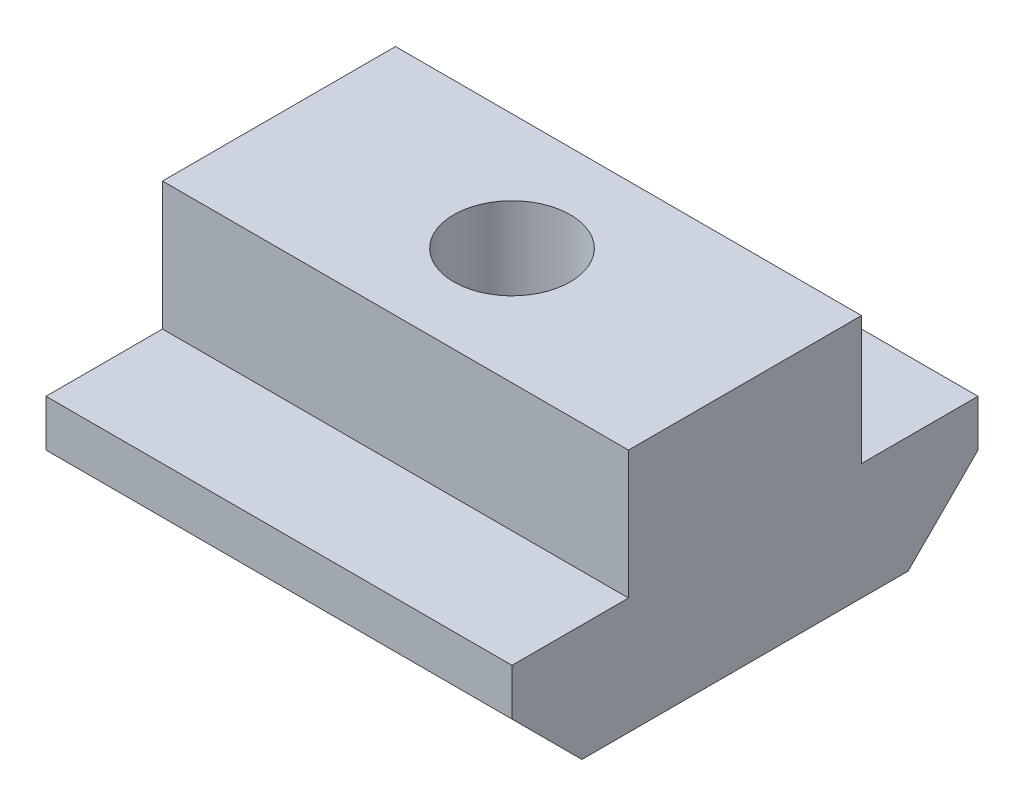
ISO-10303-21;
HEADER;
FILE_DESCRIPTION(('STEP AP214'),'2;1');
FILE_NAME('part.step','',(''),(''),'','','');
FILE_SCHEMA(('AUTOMOTIVE_DESIGN { 1 0 10303 214 1 1 1 1 }'));
ENDSEC;
DATA;
#1=APPLICATION_CONTEXT('core data for automotive mechanical design processes');
#2=APPLICATION_PROTOCOL_DEFINITION('international standard','automotive_design',2000,#1);
#3=PRODUCT_CONTEXT('',#1,'mechanical');
#4=PRODUCT('Part','Part','',(#3));
#5=PRODUCT_RELATED_PRODUCT_CATEGORY('part','',(#4));
#6=PRODUCT_DEFINITION_FORMATION('','',#4);
#7=PRODUCT_DEFINITION_CONTEXT('part definition',#1,'design');
#8=PRODUCT_DEFINITION('design','',#6,#7);
#9=PRODUCT_DEFINITION_SHAPE('','',#8);
#10=(LENGTH_UNIT() NAMED_UNIT(*) SI_UNIT(.MILLI.,.METRE.));
#11=(NAMED_UNIT(*) PLANE_ANGLE_UNIT() SI_UNIT($,.RADIAN.));
#12=(NAMED_UNIT(*) SI_UNIT($,.STERADIAN.) SOLID_ANGLE_UNIT());
#13=UNCERTAINTY_MEASURE_WITH_UNIT(LENGTH_MEASURE(1.E-05),#10,'distance_accuracy_value','');
#14=(GEOMETRIC_REPRESENTATION_CONTEXT(3) GLOBAL_UNCERTAINTY_ASSIGNED_CONTEXT((#13)) GLOBAL_UNIT_ASSIGNED_CONTEXT((#10,
#11,#12)) REPRESENTATION_CONTEXT('',''));
#15=CARTESIAN_POINT('',(0.,0.,0.));
#16=DIRECTION('',(0.,0.,1.));
#17=DIRECTION('',(1.,0.,0.));
#18=AXIS2_PLACEMENT_3D('',#15,#16,#17);
#19=CARTESIAN_POINT('',(20.,-2.25,10.));
#20=DIRECTION('',(0.,0.707106781186548,-0.707106781186548));
#21=DIRECTION('',(0.,0.707106781186548,0.707106781186548));
#22=AXIS2_PLACEMENT_3D('',#19,#20,#21);
#23=PLANE('',#22);
#24=DIRECTION('',(0.,-0.707106781186548,-0.707106781186548));
#25=VECTOR('',#24,1.);
#26=CARTESIAN_POINT('',(0.,-2.25,10.));
#27=LINE('',#26,#25);
#28=CARTESIAN_POINT('',(0.,-2.25,10.));
#29=VERTEX_POINT('',#28);
#30=CARTESIAN_POINT('',(0.,-5.25,7.));
#31=VERTEX_POINT('',#30);
#32=EDGE_CURVE('E143',#29,#31,#27,.T.);
#33=ORIENTED_EDGE('',*,*,#32,.T.);
#34=DIRECTION('',(-1.,0.,0.));
#35=VECTOR('',#34,1.);
#36=CARTESIAN_POINT('',(20.,-5.25,7.));
#37=LINE('',#36,#35);
#38=CARTESIAN_POINT('',(20.,-5.25,7.));
#39=VERTEX_POINT('',#38);
#40=EDGE_CURVE('E11',#39,#31,#37,.T.);
#41=ORIENTED_EDGE('',*,*,#40,.F.);
#42=DIRECTION('',(0.,-0.707106781186548,-0.707106781186548));
#43=VECTOR('',#42,1.);
#44=CARTESIAN_POINT('',(20.,-2.25,10.));
#45=LINE('',#44,#43);
#46=CARTESIAN_POINT('',(20.,-2.25,10.));
#47=VERTEX_POINT('',#46);
#48=EDGE_CURVE('E162',#47,#39,#45,.T.);
#49=ORIENTED_EDGE('',*,*,#48,.F.);
#50=DIRECTION('',(-1.,0.,0.));
#51=VECTOR('',#50,1.);
#52=CARTESIAN_POINT('',(20.,-2.25,10.));
#53=LINE('',#52,#51);
#54=EDGE_CURVE('E139',#47,#29,#53,.T.);
#55=ORIENTED_EDGE('',*,*,#54,.T.);
#56=EDGE_LOOP('',(#33,#41,#49,#55));
#57=FACE_BOUND('',#56,.T.);
#58=ADVANCED_FACE('F35',(#57),#23,.F.);
#59=CARTESIAN_POINT('',(20.,-5.25,7.));
#60=DIRECTION('',(0.,1.,0.));
#61=DIRECTION('',(0.,0.,1.));
#62=AXIS2_PLACEMENT_3D('',#59,#60,#61);
#63=PLANE('',#62);
#64=CARTESIAN_POINT('',(10.,-5.25,0.));
#65=DIRECTION('',(0.,1.,0.));
#66=DIRECTION('',(0.,0.,1.));
#67=AXIS2_PLACEMENT_3D('',#64,#65,#66);
#68=CIRCLE('',#67,2.5);
#69=CARTESIAN_POINT('',(10.,-5.25,2.5));
#70=VERTEX_POINT('',#69);
#71=EDGE_CURVE('E147',#70,#70,#68,.T.);
#72=ORIENTED_EDGE('',*,*,#71,.T.);
#73=EDGE_LOOP('',(#72));
#74=FACE_BOUND('',#73,.T.);
#75=DIRECTION('',(0.,0.,-1.));
#76=VECTOR('',#75,1.);
#77=CARTESIAN_POINT('',(0.,-5.25,7.));
#78=LINE('',#77,#76);
#79=CARTESIAN_POINT('',(0.,-5.25,-7.));
#80=VERTEX_POINT('',#79);
#81=EDGE_CURVE('E146',#31,#80,#78,.T.);
#82=ORIENTED_EDGE('',*,*,#81,.T.);
#83=DIRECTION('',(-1.,0.,0.));
#84=VECTOR('',#83,1.);
#85=CARTESIAN_POINT('',(20.,-5.25,-7.));
#86=LINE('',#85,#84);
#87=CARTESIAN_POINT('',(20.,-5.25,-7.));
#88=VERTEX_POINT('',#87);
#89=EDGE_CURVE('E43',#88,#80,#86,.T.);
#90=ORIENTED_EDGE('',*,*,#89,.F.);
#91=DIRECTION('',(0.,0.,-1.));
#92=VECTOR('',#91,1.);
#93=CARTESIAN_POINT('',(20.,-5.25,7.));
#94=LINE('',#93,#92);
#95=EDGE_CURVE('E100',#39,#88,#94,.T.);
#96=ORIENTED_EDGE('',*,*,#95,.F.);
#97=ORIENTED_EDGE('',*,*,#40,.T.);
#98=EDGE_LOOP('',(#82,#90,#96,#97));
#99=FACE_BOUND('',#98,.T.);
#100=ADVANCED_FACE('F215',(#74,#99),#63,.F.);
#101=CARTESIAN_POINT('',(20.,-5.25,-7.));
#102=DIRECTION('',(0.,0.707106781186548,0.707106781186547));
#103=DIRECTION('',(0.,-0.707106781186547,0.707106781186548));
#104=AXIS2_PLACEMENT_3D('',#101,#102,#103);
#105=PLANE('',#104);
#106=DIRECTION('',(0.,0.707106781186547,-0.707106781186548));
#107=VECTOR('',#106,1.);
#108=CARTESIAN_POINT('',(0.,-5.25,-7.));
#109=LINE('',#108,#107);
#110=CARTESIAN_POINT('',(0.,-2.25,-10.));
#111=VERTEX_POINT('',#110);
#112=EDGE_CURVE('E149',#80,#111,#109,.T.);
#113=ORIENTED_EDGE('',*,*,#112,.T.);
#114=DIRECTION('',(-1.,0.,0.));
#115=VECTOR('',#114,1.);
#116=CARTESIAN_POINT('',(20.,-2.25,-10.));
#117=LINE('',#116,#115);
#118=CARTESIAN_POINT('',(20.,-2.25,-10.));
#119=VERTEX_POINT('',#118);
#120=EDGE_CURVE('E175',#119,#111,#117,.T.);
#121=ORIENTED_EDGE('',*,*,#120,.F.);
#122=DIRECTION('',(0.,0.707106781186547,-0.707106781186548));
#123=VECTOR('',#122,1.);
#124=CARTESIAN_POINT('',(20.,-5.25,-7.));
#125=LINE('',#124,#123);
#126=EDGE_CURVE('E183',#88,#119,#125,.T.);
#127=ORIENTED_EDGE('',*,*,#126,.F.);
#128=ORIENTED_EDGE('',*,*,#89,.T.);
#129=EDGE_LOOP('',(#113,#121,#127,#128));
#130=FACE_BOUND('',#129,.T.);
#131=ADVANCED_FACE('F181',(#130),#105,.F.);
#132=CARTESIAN_POINT('',(20.,-2.25,-10.));
#133=DIRECTION('',(0.,0.,1.));
#134=DIRECTION('',(1.,0.,0.));
#135=AXIS2_PLACEMENT_3D('',#132,#133,#134);
#136=PLANE('',#135);
#137=DIRECTION('',(0.,1.,0.));
#138=VECTOR('',#137,1.);
#139=CARTESIAN_POINT('',(0.,-2.25,-10.));
#140=LINE('',#139,#138);
#141=CARTESIAN_POINT('',(0.,-0.249999999999999,-10.));
#142=VERTEX_POINT('',#141);
#143=EDGE_CURVE('E151',#111,#142,#140,.T.);
#144=ORIENTED_EDGE('',*,*,#143,.T.);
#145=DIRECTION('',(-1.,0.,0.));
#146=VECTOR('',#145,1.);
#147=CARTESIAN_POINT('',(20.,-0.249999999999999,-10.));
#148=LINE('',#147,#146);
#149=CARTESIAN_POINT('',(20.,-0.249999999999999,-10.));
#150=VERTEX_POINT('',#149);
#151=EDGE_CURVE('E172',#150,#142,#148,.T.);
#152=ORIENTED_EDGE('',*,*,#151,.F.);
#153=DIRECTION('',(0.,1.,0.));
#154=VECTOR('',#153,1.);
#155=CARTESIAN_POINT('',(20.,-2.25,-10.));
#156=LINE('',#155,#154);
#157=EDGE_CURVE('E201',#119,#150,#156,.T.);
#158=ORIENTED_EDGE('',*,*,#157,.F.);
#159=ORIENTED_EDGE('',*,*,#120,.T.);
#160=EDGE_LOOP('',(#144,#152,#158,#159));
#161=FACE_BOUND('',#160,.T.);
#162=ADVANCED_FACE('F192',(#161),#136,.F.);
#163=CARTESIAN_POINT('',(20.,-0.249999999999999,-5.));
#164=DIRECTION('',(0.,-1.,0.));
#165=DIRECTION('',(0.,0.,-1.));
#166=AXIS2_PLACEMENT_3D('',#163,#164,#165);
#167=PLANE('',#166);
#168=DIRECTION('',(0.,0.,1.));
#169=VECTOR('',#168,1.);
#170=CARTESIAN_POINT('',(0.,-0.249999999999999,-5.));
#171=LINE('',#170,#169);
#172=CARTESIAN_POINT('',(0.,-0.249999999999999,-5.));
#173=VERTEX_POINT('',#172);
#174=EDGE_CURVE('E153',#142,#173,#171,.T.);
#175=ORIENTED_EDGE('',*,*,#174,.T.);
#176=DIRECTION('',(-1.,0.,0.));
#177=VECTOR('',#176,1.);
#178=CARTESIAN_POINT('',(20.,-0.249999999999999,-5.));
#179=LINE('',#178,#177);
#180=CARTESIAN_POINT('',(20.,-0.249999999999999,-5.));
#181=VERTEX_POINT('',#180);
#182=EDGE_CURVE('E169',#181,#173,#179,.T.);
#183=ORIENTED_EDGE('',*,*,#182,.F.);
#184=DIRECTION('',(0.,0.,1.));
#185=VECTOR('',#184,1.);
#186=CARTESIAN_POINT('',(20.,-0.249999999999999,-5.));
#187=LINE('',#186,#185);
#188=EDGE_CURVE('E198',#150,#181,#187,.T.);
#189=ORIENTED_EDGE('',*,*,#188,.F.);
#190=ORIENTED_EDGE('',*,*,#151,.T.);
#191=EDGE_LOOP('',(#175,#183,#189,#190));
#192=FACE_BOUND('',#191,.T.);
#193=ADVANCED_FACE('F196',(#192),#167,.F.);
#194=CARTESIAN_POINT('',(20.,5.25,-5.));
#195=DIRECTION('',(0.,0.,1.));
#196=DIRECTION('',(0.,-1.,0.));
#197=AXIS2_PLACEMENT_3D('',#194,#195,#196);
#198=PLANE('',#197);
#199=DIRECTION('',(0.,1.,0.));
#200=VECTOR('',#199,1.);
#201=CARTESIAN_POINT('',(0.,5.25,-5.));
#202=LINE('',#201,#200);
#203=CARTESIAN_POINT('',(0.,5.25,-5.));
#204=VERTEX_POINT('',#203);
#205=EDGE_CURVE('E155',#173,#204,#202,.T.);
#206=ORIENTED_EDGE('',*,*,#205,.T.);
#207=DIRECTION('',(-1.,0.,0.));
#208=VECTOR('',#207,1.);
#209=CARTESIAN_POINT('',(20.,5.25,-5.));
#210=LINE('',#209,#208);
#211=CARTESIAN_POINT('',(20.,5.25,-5.));
#212=VERTEX_POINT('',#211);
#213=EDGE_CURVE('E166',#212,#204,#210,.T.);
#214=ORIENTED_EDGE('',*,*,#213,.F.);
#215=DIRECTION('',(0.,1.,0.));
#216=VECTOR('',#215,1.);
#217=CARTESIAN_POINT('',(20.,5.25,-5.));
#218=LINE('',#217,#216);
#219=EDGE_CURVE('E200',#181,#212,#218,.T.);
#220=ORIENTED_EDGE('',*,*,#219,.F.);
#221=ORIENTED_EDGE('',*,*,#182,.T.);
#222=EDGE_LOOP('',(#206,#214,#220,#221));
#223=FACE_BOUND('',#222,.T.);
#224=ADVANCED_FACE('F226',(#223),#198,.F.);
#225=CARTESIAN_POINT('',(20.,5.25,5.));
#226=DIRECTION('',(0.,-1.,0.));
#227=DIRECTION('',(0.,0.,-1.));
#228=AXIS2_PLACEMENT_3D('',#225,#226,#227);
#229=PLANE('',#228);
#230=CARTESIAN_POINT('',(10.,5.25,0.));
#231=DIRECTION('',(0.,1.,0.));
#232=DIRECTION('',(0.,0.,1.));
#233=AXIS2_PLACEMENT_3D('',#230,#231,#232);
#234=CIRCLE('',#233,2.5);
#235=CARTESIAN_POINT('',(10.,5.25,2.5));
#236=VERTEX_POINT('',#235);
#237=EDGE_CURVE('E209',#236,#236,#234,.T.);
#238=ORIENTED_EDGE('',*,*,#237,.F.);
#239=EDGE_LOOP('',(#238));
#240=FACE_BOUND('',#239,.T.);
#241=DIRECTION('',(0.,0.,1.));
#242=VECTOR('',#241,1.);
#243=CARTESIAN_POINT('',(0.,5.25,5.));
#244=LINE('',#243,#242);
#245=CARTESIAN_POINT('',(0.,5.25,5.));
#246=VERTEX_POINT('',#245);
#247=EDGE_CURVE('E157',#204,#246,#244,.T.);
#248=ORIENTED_EDGE('',*,*,#247,.T.);
#249=DIRECTION('',(-1.,0.,0.));
#250=VECTOR('',#249,1.);
#251=CARTESIAN_POINT('',(20.,5.25,5.));
#252=LINE('',#251,#250);
#253=CARTESIAN_POINT('',(20.,5.25,5.));
#254=VERTEX_POINT('',#253);
#255=EDGE_CURVE('E134',#254,#246,#252,.T.);
#256=ORIENTED_EDGE('',*,*,#255,.F.);
#257=DIRECTION('',(0.,0.,1.));
#258=VECTOR('',#257,1.);
#259=CARTESIAN_POINT('',(20.,5.25,5.));
#260=LINE('',#259,#258);
#261=EDGE_CURVE('E125',#212,#254,#260,.T.);
#262=ORIENTED_EDGE('',*,*,#261,.F.);
#263=ORIENTED_EDGE('',*,*,#213,.T.);
#264=EDGE_LOOP('',(#248,#256,#262,#263));
#265=FACE_BOUND('',#264,.T.);
#266=ADVANCED_FACE('F223',(#240,#265),#229,.F.);
#267=CARTESIAN_POINT('',(20.,5.25,5.));
#268=DIRECTION('',(0.,0.,-1.));
#269=DIRECTION('',(0.,1.,0.));
#270=AXIS2_PLACEMENT_3D('',#267,#268,#269);
#271=PLANE('',#270);
#272=DIRECTION('',(0.,-1.,0.));
#273=VECTOR('',#272,1.);
#274=CARTESIAN_POINT('',(0.,5.25,5.));
#275=LINE('',#274,#273);
#276=CARTESIAN_POINT('',(0.,-0.249999999999999,5.));
#277=VERTEX_POINT('',#276);
#278=EDGE_CURVE('E133',#246,#277,#275,.T.);
#279=ORIENTED_EDGE('',*,*,#278,.T.);
#280=DIRECTION('',(-1.,0.,0.));
#281=VECTOR('',#280,1.);
#282=CARTESIAN_POINT('',(20.,-0.249999999999999,5.));
#283=LINE('',#282,#281);
#284=CARTESIAN_POINT('',(20.,-0.249999999999999,5.));
#285=VERTEX_POINT('',#284);
#286=EDGE_CURVE('E130',#285,#277,#283,.T.);
#287=ORIENTED_EDGE('',*,*,#286,.F.);
#288=DIRECTION('',(0.,-1.,0.));
#289=VECTOR('',#288,1.);
#290=CARTESIAN_POINT('',(20.,5.25,5.));
#291=LINE('',#290,#289);
#292=EDGE_CURVE('E119',#254,#285,#291,.T.);
#293=ORIENTED_EDGE('',*,*,#292,.F.);
#294=ORIENTED_EDGE('',*,*,#255,.T.);
#295=EDGE_LOOP('',(#279,#287,#293,#294));
#296=FACE_BOUND('',#295,.T.);
#297=ADVANCED_FACE('F131',(#296),#271,.F.);
#298=CARTESIAN_POINT('',(20.,-0.249999999999999,5.));
#299=DIRECTION('',(0.,-1.,0.));
#300=DIRECTION('',(0.,0.,-1.));
#301=AXIS2_PLACEMENT_3D('',#298,#299,#300);
#302=PLANE('',#301);
#303=DIRECTION('',(0.,0.,1.));
#304=VECTOR('',#303,1.);
#305=CARTESIAN_POINT('',(0.,-0.249999999999999,5.));
#306=LINE('',#305,#304);
#307=CARTESIAN_POINT('',(0.,-0.25,10.));
#308=VERTEX_POINT('',#307);
#309=EDGE_CURVE('E86',#277,#308,#306,.T.);
#310=ORIENTED_EDGE('',*,*,#309,.T.);
#311=DIRECTION('',(-1.,0.,0.));
#312=VECTOR('',#311,1.);
#313=CARTESIAN_POINT('',(20.,-0.25,10.));
#314=LINE('',#313,#312);
#315=CARTESIAN_POINT('',(20.,-0.25,10.));
#316=VERTEX_POINT('',#315);
#317=EDGE_CURVE('E135',#316,#308,#314,.T.);
#318=ORIENTED_EDGE('',*,*,#317,.F.);
#319=DIRECTION('',(0.,0.,1.));
#320=VECTOR('',#319,1.);
#321=CARTESIAN_POINT('',(20.,-0.249999999999999,5.));
#322=LINE('',#321,#320);
#323=EDGE_CURVE('E123',#285,#316,#322,.T.);
#324=ORIENTED_EDGE('',*,*,#323,.F.);
#325=ORIENTED_EDGE('',*,*,#286,.T.);
#326=EDGE_LOOP('',(#310,#318,#324,#325));
#327=FACE_BOUND('',#326,.T.);
#328=ADVANCED_FACE('F137',(#327),#302,.F.);
#329=CARTESIAN_POINT('',(20.,-2.25,10.));
#330=DIRECTION('',(0.,0.,-1.));
#331=DIRECTION('',(-1.,0.,0.));
#332=AXIS2_PLACEMENT_3D('',#329,#330,#331);
#333=PLANE('',#332);
#334=DIRECTION('',(0.,-1.,0.));
#335=VECTOR('',#334,1.);
#336=CARTESIAN_POINT('',(0.,-2.25,10.));
#337=LINE('',#336,#335);
#338=EDGE_CURVE('E92',#308,#29,#337,.T.);
#339=ORIENTED_EDGE('',*,*,#338,.T.);
#340=ORIENTED_EDGE('',*,*,#54,.F.);
#341=DIRECTION('',(0.,-1.,0.));
#342=VECTOR('',#341,1.);
#343=CARTESIAN_POINT('',(20.,-2.25,10.));
#344=LINE('',#343,#342);
#345=EDGE_CURVE('E51',#316,#47,#344,.T.);
#346=ORIENTED_EDGE('',*,*,#345,.F.);
#347=ORIENTED_EDGE('',*,*,#317,.T.);
#348=EDGE_LOOP('',(#339,#340,#346,#347));
#349=FACE_BOUND('',#348,.T.);
#350=ADVANCED_FACE('F233',(#349),#333,.F.);
#351=CARTESIAN_POINT('',(20.,0.,0.));
#352=DIRECTION('',(1.,0.,0.));
#353=DIRECTION('',(0.,0.,-1.));
#354=AXIS2_PLACEMENT_3D('',#351,#352,#353);
#355=PLANE('',#354);
#356=ORIENTED_EDGE('',*,*,#48,.T.);
#357=ORIENTED_EDGE('',*,*,#95,.T.);
#358=ORIENTED_EDGE('',*,*,#126,.T.);
#359=ORIENTED_EDGE('',*,*,#157,.T.);
#360=ORIENTED_EDGE('',*,*,#188,.T.);
#361=ORIENTED_EDGE('',*,*,#219,.T.);
#362=ORIENTED_EDGE('',*,*,#261,.T.);
#363=ORIENTED_EDGE('',*,*,#292,.T.);
#364=ORIENTED_EDGE('',*,*,#323,.T.);
#365=ORIENTED_EDGE('',*,*,#345,.T.);
#366=EDGE_LOOP('',(#356,#357,#358,#359,#360,#361,#362,#363,#364,#365));
#367=FACE_BOUND('',#366,.T.);
#368=ADVANCED_FACE('F121',(#367),#355,.T.);
#369=CARTESIAN_POINT('',(0.,0.,0.));
#370=DIRECTION('',(1.,0.,0.));
#371=DIRECTION('',(0.,0.,-1.));
#372=AXIS2_PLACEMENT_3D('',#369,#370,#371);
#373=PLANE('',#372);
#374=ORIENTED_EDGE('',*,*,#32,.F.);
#375=ORIENTED_EDGE('',*,*,#338,.F.);
#376=ORIENTED_EDGE('',*,*,#309,.F.);
#377=ORIENTED_EDGE('',*,*,#278,.F.);
#378=ORIENTED_EDGE('',*,*,#247,.F.);
#379=ORIENTED_EDGE('',*,*,#205,.F.);
#380=ORIENTED_EDGE('',*,*,#174,.F.);
#381=ORIENTED_EDGE('',*,*,#143,.F.);
#382=ORIENTED_EDGE('',*,*,#112,.F.);
#383=ORIENTED_EDGE('',*,*,#81,.F.);
#384=EDGE_LOOP('',(#374,#375,#376,#377,#378,#379,#380,#381,#382,#383));
#385=FACE_BOUND('',#384,.T.);
#386=ADVANCED_FACE('F187',(#385),#373,.F.);
#387=CARTESIAN_POINT('',(10.,-5.25,0.));
#388=DIRECTION('',(0.,1.,0.));
#389=DIRECTION('',(0.,0.,1.));
#390=AXIS2_PLACEMENT_3D('',#387,#388,#389);
#391=CYLINDRICAL_SURFACE('',#390,2.5);
#392=ORIENTED_EDGE('',*,*,#71,.F.);
#393=EDGE_LOOP('',(#392));
#394=FACE_BOUND('',#393,.T.);
#395=ORIENTED_EDGE('',*,*,#237,.T.);
#396=EDGE_LOOP('',(#395));
#397=FACE_BOUND('',#396,.T.);
#398=ADVANCED_FACE('F217',(#394,#397),#391,.F.);
#399=CLOSED_SHELL('',(#58,#100,#131,#162,#193,#224,#266,#297,#328,#350,#368,#386,#398));
#400=MANIFOLD_SOLID_BREP('B2',#399);
#401=ADVANCED_BREP_SHAPE_REPRESENTATION('',(#18,#400),#14);
#402=SHAPE_DEFINITION_REPRESENTATION(#9,#401);
ENDSEC;
END-ISO-10303-21;
